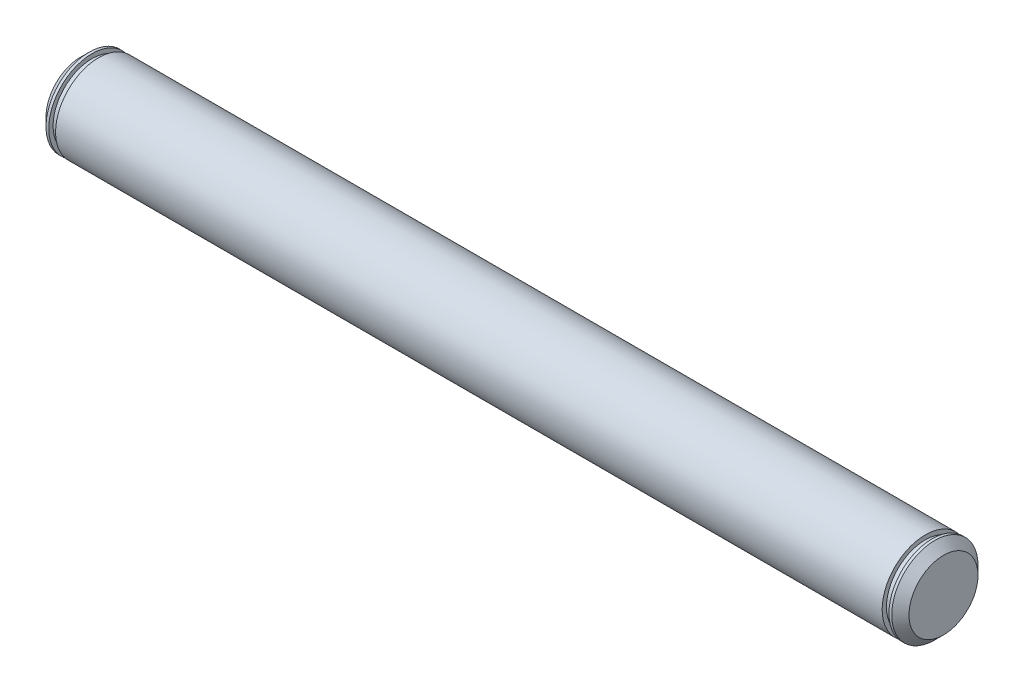
ISO-10303-21;
HEADER;
FILE_DESCRIPTION(('STEP AP214'),'2;1');
FILE_NAME('part.step','',(''),(''),'','','');
FILE_SCHEMA(('AUTOMOTIVE_DESIGN { 1 0 10303 214 1 1 1 1 }'));
ENDSEC;
DATA;
#1=APPLICATION_CONTEXT('core data for automotive mechanical design processes');
#2=APPLICATION_PROTOCOL_DEFINITION('international standard','automotive_design',2000,#1);
#3=PRODUCT_CONTEXT('',#1,'mechanical');
#4=PRODUCT('Part','Part','',(#3));
#5=PRODUCT_RELATED_PRODUCT_CATEGORY('part','',(#4));
#6=PRODUCT_DEFINITION_FORMATION('','',#4);
#7=PRODUCT_DEFINITION_CONTEXT('part definition',#1,'design');
#8=PRODUCT_DEFINITION('design','',#6,#7);
#9=PRODUCT_DEFINITION_SHAPE('','',#8);
#10=(LENGTH_UNIT() NAMED_UNIT(*) SI_UNIT(.MILLI.,.METRE.));
#11=(NAMED_UNIT(*) PLANE_ANGLE_UNIT() SI_UNIT($,.RADIAN.));
#12=(NAMED_UNIT(*) SI_UNIT($,.STERADIAN.) SOLID_ANGLE_UNIT());
#13=UNCERTAINTY_MEASURE_WITH_UNIT(LENGTH_MEASURE(1.E-05),#10,'distance_accuracy_value','');
#14=(GEOMETRIC_REPRESENTATION_CONTEXT(3) GLOBAL_UNCERTAINTY_ASSIGNED_CONTEXT((#13)) GLOBAL_UNIT_ASSIGNED_CONTEXT((#10,
#11,#12)) REPRESENTATION_CONTEXT('',''));
#15=CARTESIAN_POINT('',(0.,0.,0.));
#16=DIRECTION('',(0.,0.,1.));
#17=DIRECTION('',(1.,0.,0.));
#18=AXIS2_PLACEMENT_3D('',#15,#16,#17);
#19=CARTESIAN_POINT('',(-63.5000000000001,0.,0.));
#20=DIRECTION('',(1.,0.,0.));
#21=DIRECTION('',(0.,0.,-1.));
#22=AXIS2_PLACEMENT_3D('',#19,#20,#21);
#23=CYLINDRICAL_SURFACE('',#22,6.35);
#24=CARTESIAN_POINT('',(-60.8239427020851,0.,0.));
#25=DIRECTION('',(-1.,0.,0.));
#26=DIRECTION('',(0.,0.,1.));
#27=AXIS2_PLACEMENT_3D('',#24,#25,#26);
#28=CIRCLE('',#27,6.35);
#29=CARTESIAN_POINT('',(-60.8239427020851,0.,6.35));
#30=VERTEX_POINT('',#29);
#31=EDGE_CURVE('E62',#30,#30,#28,.T.);
#32=ORIENTED_EDGE('',*,*,#31,.F.);
#33=EDGE_LOOP('',(#32));
#34=FACE_BOUND('',#33,.T.);
#35=CARTESIAN_POINT('',(60.8239427020851,0.,0.));
#36=DIRECTION('',(-1.,0.,0.));
#37=DIRECTION('',(0.,0.,1.));
#38=AXIS2_PLACEMENT_3D('',#35,#36,#37);
#39=CIRCLE('',#38,6.35);
#40=CARTESIAN_POINT('',(60.8239427020851,0.,6.35));
#41=VERTEX_POINT('',#40);
#42=EDGE_CURVE('E78',#41,#41,#39,.T.);
#43=ORIENTED_EDGE('',*,*,#42,.T.);
#44=EDGE_LOOP('',(#43));
#45=FACE_BOUND('',#44,.T.);
#46=ADVANCED_FACE('F37',(#34,#45),#23,.T.);
#47=CARTESIAN_POINT('',(-61.8239427020851,0.,0.));
#48=DIRECTION('',(-1.,0.,0.));
#49=DIRECTION('',(0.,0.,1.));
#50=AXIS2_PLACEMENT_3D('',#47,#48,#49);
#51=CIRCLE('',#50,6.35);
#52=CARTESIAN_POINT('',(-61.8239427020851,0.,6.35));
#53=VERTEX_POINT('',#52);
#54=EDGE_CURVE('E61',#53,#53,#51,.T.);
#55=ORIENTED_EDGE('',*,*,#54,.T.);
#56=EDGE_LOOP('',(#55));
#57=FACE_BOUND('',#56,.T.);
#58=CARTESIAN_POINT('',(-62.2300000000001,0.,0.));
#59=DIRECTION('',(1.,0.,0.));
#60=DIRECTION('',(0.,0.,-1.));
#61=AXIS2_PLACEMENT_3D('',#58,#59,#60);
#62=CIRCLE('',#61,6.35);
#63=CARTESIAN_POINT('',(-62.2300000000001,0.,-6.35));
#64=VERTEX_POINT('',#63);
#65=EDGE_CURVE('E50',#64,#64,#62,.T.);
#66=ORIENTED_EDGE('',*,*,#65,.T.);
#67=EDGE_LOOP('',(#66));
#68=FACE_BOUND('',#67,.T.);
#69=ADVANCED_FACE('F109',(#57,#68),#23,.T.);
#70=CARTESIAN_POINT('',(-63.5000000000001,0.,0.));
#71=DIRECTION('',(1.,0.,0.));
#72=DIRECTION('',(0.,0.,-1.));
#73=AXIS2_PLACEMENT_3D('',#70,#71,#72);
#74=PLANE('',#73);
#75=CARTESIAN_POINT('',(-63.5000000000001,0.,0.));
#76=DIRECTION('',(1.,0.,0.));
#77=DIRECTION('',(0.,0.,-1.));
#78=AXIS2_PLACEMENT_3D('',#75,#76,#77);
#79=CIRCLE('',#78,5.08000000000002);
#80=CARTESIAN_POINT('',(-63.5000000000001,0.,-5.08000000000002));
#81=VERTEX_POINT('',#80);
#82=EDGE_CURVE('E10',#81,#81,#79,.F.);
#83=ORIENTED_EDGE('',*,*,#82,.T.);
#84=EDGE_LOOP('',(#83));
#85=FACE_BOUND('',#84,.T.);
#86=ADVANCED_FACE('F118',(#85),#74,.F.);
#87=CARTESIAN_POINT('',(-62.2300000000001,0.,0.));
#88=DIRECTION('',(1.,0.,0.));
#89=DIRECTION('',(0.,0.,-1.));
#90=AXIS2_PLACEMENT_3D('',#87,#88,#89);
#91=CONICAL_SURFACE('',#90,6.35,0.785398163397445);
#92=ORIENTED_EDGE('',*,*,#82,.F.);
#93=EDGE_LOOP('',(#92));
#94=FACE_BOUND('',#93,.T.);
#95=ORIENTED_EDGE('',*,*,#65,.F.);
#96=EDGE_LOOP('',(#95));
#97=FACE_BOUND('',#96,.T.);
#98=ADVANCED_FACE('F39',(#94,#97),#91,.T.);
#99=CARTESIAN_POINT('',(-61.8239427020851,0.,0.));
#100=DIRECTION('',(-1.,0.,0.));
#101=DIRECTION('',(0.,0.,1.));
#102=AXIS2_PLACEMENT_3D('',#99,#100,#101);
#103=PLANE('',#102);
#104=ORIENTED_EDGE('',*,*,#54,.F.);
#105=EDGE_LOOP('',(#104));
#106=FACE_BOUND('',#105,.T.);
#107=CARTESIAN_POINT('',(-61.8239427020851,0.,0.));
#108=DIRECTION('',(-1.,0.,0.));
#109=DIRECTION('',(0.,0.,1.));
#110=AXIS2_PLACEMENT_3D('',#107,#108,#109);
#111=CIRCLE('',#110,5.715);
#112=CARTESIAN_POINT('',(-61.8239427020851,0.,5.715));
#113=VERTEX_POINT('',#112);
#114=EDGE_CURVE('E66',#113,#113,#111,.T.);
#115=ORIENTED_EDGE('',*,*,#114,.T.);
#116=EDGE_LOOP('',(#115));
#117=FACE_BOUND('',#116,.T.);
#118=ADVANCED_FACE('F142',(#106,#117),#103,.F.);
#119=CARTESIAN_POINT('',(-60.8239427020851,0.,0.));
#120=DIRECTION('',(-1.,0.,0.));
#121=DIRECTION('',(0.,0.,1.));
#122=AXIS2_PLACEMENT_3D('',#119,#120,#121);
#123=PLANE('',#122);
#124=ORIENTED_EDGE('',*,*,#31,.T.);
#125=EDGE_LOOP('',(#124));
#126=FACE_BOUND('',#125,.T.);
#127=CARTESIAN_POINT('',(-60.8239427020851,0.,0.));
#128=DIRECTION('',(-1.,0.,0.));
#129=DIRECTION('',(0.,0.,1.));
#130=AXIS2_PLACEMENT_3D('',#127,#128,#129);
#131=CIRCLE('',#130,5.715);
#132=CARTESIAN_POINT('',(-60.8239427020851,0.,5.715));
#133=VERTEX_POINT('',#132);
#134=EDGE_CURVE('E70',#133,#133,#131,.T.);
#135=ORIENTED_EDGE('',*,*,#134,.F.);
#136=EDGE_LOOP('',(#135));
#137=FACE_BOUND('',#136,.T.);
#138=ADVANCED_FACE('F140',(#126,#137),#123,.T.);
#139=CARTESIAN_POINT('',(-61.8239427020851,0.,0.));
#140=DIRECTION('',(1.,0.,0.));
#141=DIRECTION('',(0.,0.,-1.));
#142=AXIS2_PLACEMENT_3D('',#139,#140,#141);
#143=CYLINDRICAL_SURFACE('',#142,5.715);
#144=ORIENTED_EDGE('',*,*,#114,.F.);
#145=EDGE_LOOP('',(#144));
#146=FACE_BOUND('',#145,.T.);
#147=ORIENTED_EDGE('',*,*,#134,.T.);
#148=EDGE_LOOP('',(#147));
#149=FACE_BOUND('',#148,.T.);
#150=ADVANCED_FACE('F101',(#146,#149),#143,.T.);
#151=CARTESIAN_POINT('',(61.8239427020851,0.,0.));
#152=DIRECTION('',(1.,0.,0.));
#153=DIRECTION('',(0.,0.,1.));
#154=AXIS2_PLACEMENT_3D('',#151,#152,#153);
#155=PLANE('',#154);
#156=CARTESIAN_POINT('',(61.8239427020851,0.,0.));
#157=DIRECTION('',(-1.,0.,0.));
#158=DIRECTION('',(0.,0.,1.));
#159=AXIS2_PLACEMENT_3D('',#156,#157,#158);
#160=CIRCLE('',#159,5.715);
#161=CARTESIAN_POINT('',(61.8239427020851,0.,5.715));
#162=VERTEX_POINT('',#161);
#163=EDGE_CURVE('E82',#162,#162,#160,.T.);
#164=ORIENTED_EDGE('',*,*,#163,.F.);
#165=EDGE_LOOP('',(#164));
#166=FACE_BOUND('',#165,.T.);
#167=CARTESIAN_POINT('',(61.8239427020851,0.,0.));
#168=DIRECTION('',(-1.,0.,0.));
#169=DIRECTION('',(0.,0.,1.));
#170=AXIS2_PLACEMENT_3D('',#167,#168,#169);
#171=CIRCLE('',#170,6.35);
#172=CARTESIAN_POINT('',(61.8239427020851,0.,6.35));
#173=VERTEX_POINT('',#172);
#174=EDGE_CURVE('E74',#173,#173,#171,.T.);
#175=ORIENTED_EDGE('',*,*,#174,.T.);
#176=EDGE_LOOP('',(#175));
#177=FACE_BOUND('',#176,.T.);
#178=ADVANCED_FACE('F97',(#166,#177),#155,.F.);
#179=CARTESIAN_POINT('',(60.8239427020851,0.,0.));
#180=DIRECTION('',(1.,0.,0.));
#181=DIRECTION('',(0.,0.,1.));
#182=AXIS2_PLACEMENT_3D('',#179,#180,#181);
#183=PLANE('',#182);
#184=CARTESIAN_POINT('',(60.8239427020851,0.,0.));
#185=DIRECTION('',(-1.,0.,0.));
#186=DIRECTION('',(0.,0.,1.));
#187=AXIS2_PLACEMENT_3D('',#184,#185,#186);
#188=CIRCLE('',#187,5.715);
#189=CARTESIAN_POINT('',(60.8239427020851,0.,5.715));
#190=VERTEX_POINT('',#189);
#191=EDGE_CURVE('E86',#190,#190,#188,.T.);
#192=ORIENTED_EDGE('',*,*,#191,.T.);
#193=EDGE_LOOP('',(#192));
#194=FACE_BOUND('',#193,.T.);
#195=ORIENTED_EDGE('',*,*,#42,.F.);
#196=EDGE_LOOP('',(#195));
#197=FACE_BOUND('',#196,.T.);
#198=ADVANCED_FACE('F100',(#194,#197),#183,.T.);
#199=CARTESIAN_POINT('',(61.8239427020851,0.,0.));
#200=DIRECTION('',(-1.,0.,0.));
#201=DIRECTION('',(0.,0.,1.));
#202=AXIS2_PLACEMENT_3D('',#199,#200,#201);
#203=CYLINDRICAL_SURFACE('',#202,5.715);
#204=ORIENTED_EDGE('',*,*,#163,.T.);
#205=EDGE_LOOP('',(#204));
#206=FACE_BOUND('',#205,.T.);
#207=ORIENTED_EDGE('',*,*,#191,.F.);
#208=EDGE_LOOP('',(#207));
#209=FACE_BOUND('',#208,.T.);
#210=ADVANCED_FACE('F94',(#206,#209),#203,.T.);
#211=CARTESIAN_POINT('',(63.5000000000001,0.,0.));
#212=DIRECTION('',(1.,0.,0.));
#213=DIRECTION('',(0.,0.,-1.));
#214=AXIS2_PLACEMENT_3D('',#211,#212,#213);
#215=PLANE('',#214);
#216=CARTESIAN_POINT('',(63.5000000000001,0.,0.));
#217=DIRECTION('',(1.,0.,0.));
#218=DIRECTION('',(0.,0.,-1.));
#219=AXIS2_PLACEMENT_3D('',#216,#217,#218);
#220=CIRCLE('',#219,5.07999999999997);
#221=CARTESIAN_POINT('',(63.5000000000001,0.,-5.07999999999997));
#222=VERTEX_POINT('',#221);
#223=EDGE_CURVE('E55',#222,#222,#220,.T.);
#224=ORIENTED_EDGE('',*,*,#223,.T.);
#225=EDGE_LOOP('',(#224));
#226=FACE_BOUND('',#225,.T.);
#227=ADVANCED_FACE('F114',(#226),#215,.T.);
#228=CARTESIAN_POINT('',(63.5000000000001,0.,0.));
#229=DIRECTION('',(-1.,0.,0.));
#230=DIRECTION('',(0.,0.,1.));
#231=AXIS2_PLACEMENT_3D('',#228,#229,#230);
#232=CONICAL_SURFACE('',#231,5.07999999999997,0.78539816339745);
#233=CARTESIAN_POINT('',(62.2300000000001,0.,0.));
#234=DIRECTION('',(1.,0.,0.));
#235=DIRECTION('',(0.,0.,-1.));
#236=AXIS2_PLACEMENT_3D('',#233,#234,#235);
#237=CIRCLE('',#236,6.35);
#238=CARTESIAN_POINT('',(62.2300000000001,0.,-6.35));
#239=VERTEX_POINT('',#238);
#240=EDGE_CURVE('E45',#239,#239,#237,.F.);
#241=ORIENTED_EDGE('',*,*,#240,.F.);
#242=EDGE_LOOP('',(#241));
#243=FACE_BOUND('',#242,.T.);
#244=ORIENTED_EDGE('',*,*,#223,.F.);
#245=EDGE_LOOP('',(#244));
#246=FACE_BOUND('',#245,.T.);
#247=ADVANCED_FACE('F107',(#243,#246),#232,.T.);
#248=ORIENTED_EDGE('',*,*,#174,.F.);
#249=EDGE_LOOP('',(#248));
#250=FACE_BOUND('',#249,.T.);
#251=ORIENTED_EDGE('',*,*,#240,.T.);
#252=EDGE_LOOP('',(#251));
#253=FACE_BOUND('',#252,.T.);
#254=ADVANCED_FACE('F105',(#250,#253),#23,.T.);
#255=CLOSED_SHELL('',(#46,#69,#86,#98,#118,#138,#150,#178,#198,#210,#227,#247,#254));
#256=MANIFOLD_SOLID_BREP('B2',#255);
#257=ADVANCED_BREP_SHAPE_REPRESENTATION('',(#18,#256),#14);
#258=SHAPE_DEFINITION_REPRESENTATION(#9,#257);
ENDSEC;
END-ISO-10303-21;
